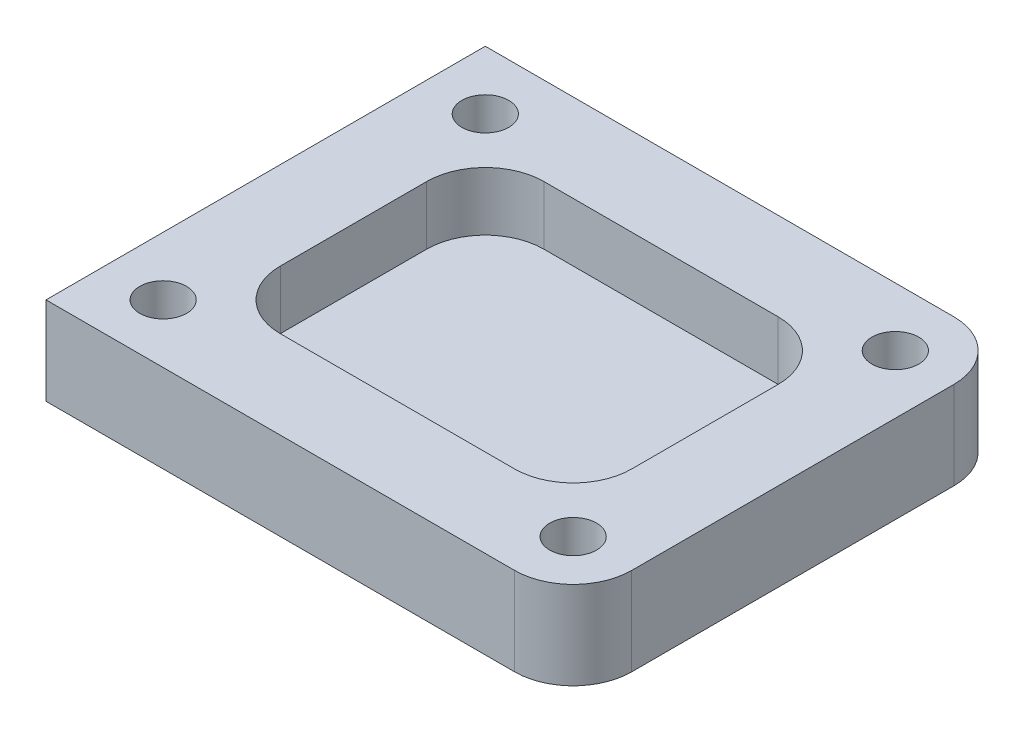
ISO-10303-21;
HEADER;
FILE_DESCRIPTION(('STEP AP214'),'2;1');
FILE_NAME('part.step','',(''),(''),'','','');
FILE_SCHEMA(('AUTOMOTIVE_DESIGN { 1 0 10303 214 1 1 1 1 }'));
ENDSEC;
DATA;
#1=APPLICATION_CONTEXT('core data for automotive mechanical design processes');
#2=APPLICATION_PROTOCOL_DEFINITION('international standard','automotive_design',2000,#1);
#3=PRODUCT_CONTEXT('',#1,'mechanical');
#4=PRODUCT('Part','Part','',(#3));
#5=PRODUCT_RELATED_PRODUCT_CATEGORY('part','',(#4));
#6=PRODUCT_DEFINITION_FORMATION('','',#4);
#7=PRODUCT_DEFINITION_CONTEXT('part definition',#1,'design');
#8=PRODUCT_DEFINITION('design','',#6,#7);
#9=PRODUCT_DEFINITION_SHAPE('','',#8);
#10=(LENGTH_UNIT() NAMED_UNIT(*) SI_UNIT(.MILLI.,.METRE.));
#11=(NAMED_UNIT(*) PLANE_ANGLE_UNIT() SI_UNIT($,.RADIAN.));
#12=(NAMED_UNIT(*) SI_UNIT($,.STERADIAN.) SOLID_ANGLE_UNIT());
#13=UNCERTAINTY_MEASURE_WITH_UNIT(LENGTH_MEASURE(1.E-05),#10,'distance_accuracy_value','');
#14=(GEOMETRIC_REPRESENTATION_CONTEXT(3) GLOBAL_UNCERTAINTY_ASSIGNED_CONTEXT((#13)) GLOBAL_UNIT_ASSIGNED_CONTEXT((#10,
#11,#12)) REPRESENTATION_CONTEXT('',''));
#15=CARTESIAN_POINT('',(0.,0.,0.));
#16=DIRECTION('',(0.,0.,1.));
#17=DIRECTION('',(1.,0.,0.));
#18=AXIS2_PLACEMENT_3D('',#15,#16,#17);
#19=CARTESIAN_POINT('',(90.,30.,75.));
#20=DIRECTION('',(-1.,0.,0.));
#21=DIRECTION('',(0.,0.,1.));
#22=AXIS2_PLACEMENT_3D('',#19,#20,#21);
#23=PLANE('',#22);
#24=DIRECTION('',(0.,0.,-1.));
#25=VECTOR('',#24,1.);
#26=CARTESIAN_POINT('',(90.,30.,75.));
#27=LINE('',#26,#25);
#28=CARTESIAN_POINT('',(90.,30.,55.));
#29=VERTEX_POINT('',#28);
#30=CARTESIAN_POINT('',(90.,30.,-55.));
#31=VERTEX_POINT('',#30);
#32=EDGE_CURVE('E194',#29,#31,#27,.T.);
#33=ORIENTED_EDGE('',*,*,#32,.F.);
#34=DIRECTION('',(0.,-1.,0.));
#35=VECTOR('',#34,1.);
#36=CARTESIAN_POINT('',(90.,30.,55.));
#37=LINE('',#36,#35);
#38=CARTESIAN_POINT('',(90.,0.,55.));
#39=VERTEX_POINT('',#38);
#40=EDGE_CURVE('E262',#29,#39,#37,.T.);
#41=ORIENTED_EDGE('',*,*,#40,.T.);
#42=DIRECTION('',(0.,0.,-1.));
#43=VECTOR('',#42,1.);
#44=CARTESIAN_POINT('',(90.,0.,75.));
#45=LINE('',#44,#43);
#46=CARTESIAN_POINT('',(90.,0.,-55.));
#47=VERTEX_POINT('',#46);
#48=EDGE_CURVE('E193',#39,#47,#45,.T.);
#49=ORIENTED_EDGE('',*,*,#48,.T.);
#50=DIRECTION('',(0.,-1.,0.));
#51=VECTOR('',#50,1.);
#52=CARTESIAN_POINT('',(90.,30.,-55.));
#53=LINE('',#52,#51);
#54=EDGE_CURVE('E260',#47,#31,#53,.F.);
#55=ORIENTED_EDGE('',*,*,#54,.T.);
#56=EDGE_LOOP('',(#33,#41,#49,#55));
#57=FACE_BOUND('',#56,.T.);
#58=ADVANCED_FACE('F40',(#57),#23,.F.);
#59=CARTESIAN_POINT('',(-90.,30.,-75.));
#60=DIRECTION('',(0.,0.,1.));
#61=DIRECTION('',(1.,0.,0.));
#62=AXIS2_PLACEMENT_3D('',#59,#60,#61);
#63=PLANE('',#62);
#64=DIRECTION('',(-1.,0.,0.));
#65=VECTOR('',#64,1.);
#66=CARTESIAN_POINT('',(-90.,30.,-75.));
#67=LINE('',#66,#65);
#68=CARTESIAN_POINT('',(70.,30.,-75.));
#69=VERTEX_POINT('',#68);
#70=CARTESIAN_POINT('',(-90.,30.,-75.));
#71=VERTEX_POINT('',#70);
#72=EDGE_CURVE('E197',#69,#71,#67,.T.);
#73=ORIENTED_EDGE('',*,*,#72,.F.);
#74=DIRECTION('',(0.,-1.,0.));
#75=VECTOR('',#74,1.);
#76=CARTESIAN_POINT('',(70.,30.,-75.));
#77=LINE('',#76,#75);
#78=CARTESIAN_POINT('',(70.,0.,-75.));
#79=VERTEX_POINT('',#78);
#80=EDGE_CURVE('E12',#69,#79,#77,.T.);
#81=ORIENTED_EDGE('',*,*,#80,.T.);
#82=DIRECTION('',(-1.,0.,0.));
#83=VECTOR('',#82,1.);
#84=CARTESIAN_POINT('',(-90.,0.,-75.));
#85=LINE('',#84,#83);
#86=CARTESIAN_POINT('',(-90.,0.,-75.));
#87=VERTEX_POINT('',#86);
#88=EDGE_CURVE('E210',#79,#87,#85,.T.);
#89=ORIENTED_EDGE('',*,*,#88,.T.);
#90=DIRECTION('',(0.,-1.,0.));
#91=VECTOR('',#90,1.);
#92=CARTESIAN_POINT('',(-90.,30.,-75.));
#93=LINE('',#92,#91);
#94=EDGE_CURVE('E217',#71,#87,#93,.T.);
#95=ORIENTED_EDGE('',*,*,#94,.F.);
#96=EDGE_LOOP('',(#73,#81,#89,#95));
#97=FACE_BOUND('',#96,.T.);
#98=ADVANCED_FACE('F294',(#97),#63,.F.);
#99=CARTESIAN_POINT('',(-90.,30.,75.));
#100=DIRECTION('',(1.,0.,0.));
#101=DIRECTION('',(0.,0.,-1.));
#102=AXIS2_PLACEMENT_3D('',#99,#100,#101);
#103=PLANE('',#102);
#104=DIRECTION('',(0.,0.,1.));
#105=VECTOR('',#104,1.);
#106=CARTESIAN_POINT('',(-90.,0.,75.));
#107=LINE('',#106,#105);
#108=CARTESIAN_POINT('',(-90.,0.,75.));
#109=VERTEX_POINT('',#108);
#110=EDGE_CURVE('E212',#87,#109,#107,.T.);
#111=ORIENTED_EDGE('',*,*,#110,.T.);
#112=DIRECTION('',(0.,-1.,0.));
#113=VECTOR('',#112,1.);
#114=CARTESIAN_POINT('',(-90.,30.,75.));
#115=LINE('',#114,#113);
#116=CARTESIAN_POINT('',(-90.,30.,75.));
#117=VERTEX_POINT('',#116);
#118=EDGE_CURVE('E207',#117,#109,#115,.T.);
#119=ORIENTED_EDGE('',*,*,#118,.F.);
#120=DIRECTION('',(0.,0.,1.));
#121=VECTOR('',#120,1.);
#122=CARTESIAN_POINT('',(-90.,30.,75.));
#123=LINE('',#122,#121);
#124=EDGE_CURVE('E201',#71,#117,#123,.T.);
#125=ORIENTED_EDGE('',*,*,#124,.F.);
#126=ORIENTED_EDGE('',*,*,#94,.T.);
#127=EDGE_LOOP('',(#111,#119,#125,#126));
#128=FACE_BOUND('',#127,.T.);
#129=ADVANCED_FACE('F290',(#128),#103,.F.);
#130=CARTESIAN_POINT('',(-90.,30.,75.));
#131=DIRECTION('',(0.,0.,-1.));
#132=DIRECTION('',(-1.,0.,0.));
#133=AXIS2_PLACEMENT_3D('',#130,#131,#132);
#134=PLANE('',#133);
#135=DIRECTION('',(1.,0.,0.));
#136=VECTOR('',#135,1.);
#137=CARTESIAN_POINT('',(-90.,0.,75.));
#138=LINE('',#137,#136);
#139=CARTESIAN_POINT('',(70.,0.,75.));
#140=VERTEX_POINT('',#139);
#141=EDGE_CURVE('E198',#109,#140,#138,.T.);
#142=ORIENTED_EDGE('',*,*,#141,.T.);
#143=DIRECTION('',(0.,-1.,0.));
#144=VECTOR('',#143,1.);
#145=CARTESIAN_POINT('',(70.,30.,75.));
#146=LINE('',#145,#144);
#147=CARTESIAN_POINT('',(70.,30.,75.));
#148=VERTEX_POINT('',#147);
#149=EDGE_CURVE('E63',#140,#148,#146,.F.);
#150=ORIENTED_EDGE('',*,*,#149,.T.);
#151=DIRECTION('',(1.,0.,0.));
#152=VECTOR('',#151,1.);
#153=CARTESIAN_POINT('',(-90.,30.,75.));
#154=LINE('',#153,#152);
#155=EDGE_CURVE('E204',#117,#148,#154,.T.);
#156=ORIENTED_EDGE('',*,*,#155,.F.);
#157=ORIENTED_EDGE('',*,*,#118,.T.);
#158=EDGE_LOOP('',(#142,#150,#156,#157));
#159=FACE_BOUND('',#158,.T.);
#160=ADVANCED_FACE('F286',(#159),#134,.F.);
#161=CARTESIAN_POINT('',(0.,30.,0.));
#162=DIRECTION('',(0.,-1.,0.));
#163=DIRECTION('',(0.,0.,-1.));
#164=AXIS2_PLACEMENT_3D('',#161,#162,#163);
#165=PLANE('',#164);
#166=DIRECTION('',(-1.,0.,0.));
#167=VECTOR('',#166,1.);
#168=CARTESIAN_POINT('',(60.,30.,-45.));
#169=LINE('',#168,#167);
#170=CARTESIAN_POINT('',(40.,30.,-45.));
#171=VERTEX_POINT('',#170);
#172=CARTESIAN_POINT('',(-40.,30.,-45.));
#173=VERTEX_POINT('',#172);
#174=EDGE_CURVE('E360',#171,#173,#169,.T.);
#175=ORIENTED_EDGE('',*,*,#174,.F.);
#176=CARTESIAN_POINT('',(40.,30.,-25.));
#177=DIRECTION('',(0.,-1.,0.));
#178=DIRECTION('',(0.,0.,-1.));
#179=AXIS2_PLACEMENT_3D('',#176,#177,#178);
#180=CIRCLE('',#179,20.);
#181=CARTESIAN_POINT('',(60.,30.,-25.));
#182=VERTEX_POINT('',#181);
#183=EDGE_CURVE('E254',#171,#182,#180,.T.);
#184=ORIENTED_EDGE('',*,*,#183,.T.);
#185=DIRECTION('',(0.,0.,-1.));
#186=VECTOR('',#185,1.);
#187=CARTESIAN_POINT('',(60.,30.,45.));
#188=LINE('',#187,#186);
#189=CARTESIAN_POINT('',(60.,30.,25.));
#190=VERTEX_POINT('',#189);
#191=EDGE_CURVE('E356',#190,#182,#188,.T.);
#192=ORIENTED_EDGE('',*,*,#191,.F.);
#193=CARTESIAN_POINT('',(40.,30.,25.));
#194=DIRECTION('',(0.,-1.,0.));
#195=DIRECTION('',(0.,0.,-1.));
#196=AXIS2_PLACEMENT_3D('',#193,#194,#195);
#197=CIRCLE('',#196,20.);
#198=CARTESIAN_POINT('',(40.,30.,45.));
#199=VERTEX_POINT('',#198);
#200=EDGE_CURVE('E248',#190,#199,#197,.T.);
#201=ORIENTED_EDGE('',*,*,#200,.T.);
#202=DIRECTION('',(1.,0.,0.));
#203=VECTOR('',#202,1.);
#204=CARTESIAN_POINT('',(-60.,30.,45.));
#205=LINE('',#204,#203);
#206=CARTESIAN_POINT('',(-40.,30.,45.));
#207=VERTEX_POINT('',#206);
#208=EDGE_CURVE('E352',#207,#199,#205,.T.);
#209=ORIENTED_EDGE('',*,*,#208,.F.);
#210=CARTESIAN_POINT('',(-40.,30.,25.));
#211=DIRECTION('',(0.,-1.,0.));
#212=DIRECTION('',(0.,0.,-1.));
#213=AXIS2_PLACEMENT_3D('',#210,#211,#212);
#214=CIRCLE('',#213,20.);
#215=CARTESIAN_POINT('',(-60.,30.,25.));
#216=VERTEX_POINT('',#215);
#217=EDGE_CURVE('E251',#207,#216,#214,.T.);
#218=ORIENTED_EDGE('',*,*,#217,.T.);
#219=DIRECTION('',(0.,0.,1.));
#220=VECTOR('',#219,1.);
#221=CARTESIAN_POINT('',(-60.,30.,-45.));
#222=LINE('',#221,#220);
#223=CARTESIAN_POINT('',(-60.,30.,-25.));
#224=VERTEX_POINT('',#223);
#225=EDGE_CURVE('E351',#224,#216,#222,.T.);
#226=ORIENTED_EDGE('',*,*,#225,.F.);
#227=CARTESIAN_POINT('',(-40.,30.,-25.));
#228=DIRECTION('',(0.,-1.,0.));
#229=DIRECTION('',(0.,0.,-1.));
#230=AXIS2_PLACEMENT_3D('',#227,#228,#229);
#231=CIRCLE('',#230,20.);
#232=EDGE_CURVE('E257',#224,#173,#231,.T.);
#233=ORIENTED_EDGE('',*,*,#232,.T.);
#234=EDGE_LOOP('',(#175,#184,#192,#201,#209,#218,#226,#233));
#235=FACE_BOUND('',#234,.T.);
#236=CARTESIAN_POINT('',(-70.,30.,55.));
#237=DIRECTION('',(0.,1.,0.));
#238=DIRECTION('',(0.,0.,1.));
#239=AXIS2_PLACEMENT_3D('',#236,#237,#238);
#240=CIRCLE('',#239,7.99999999999999);
#241=CARTESIAN_POINT('',(-70.,30.,63.));
#242=VERTEX_POINT('',#241);
#243=EDGE_CURVE('E165',#242,#242,#240,.T.);
#244=ORIENTED_EDGE('',*,*,#243,.F.);
#245=EDGE_LOOP('',(#244));
#246=FACE_BOUND('',#245,.T.);
#247=CARTESIAN_POINT('',(-70.,30.,-55.));
#248=DIRECTION('',(0.,1.,0.));
#249=DIRECTION('',(0.,0.,1.));
#250=AXIS2_PLACEMENT_3D('',#247,#248,#249);
#251=CIRCLE('',#250,7.99999999999999);
#252=CARTESIAN_POINT('',(-70.,30.,-47.));
#253=VERTEX_POINT('',#252);
#254=EDGE_CURVE('E164',#253,#253,#251,.T.);
#255=ORIENTED_EDGE('',*,*,#254,.F.);
#256=EDGE_LOOP('',(#255));
#257=FACE_BOUND('',#256,.T.);
#258=CARTESIAN_POINT('',(70.,30.,-55.));
#259=DIRECTION('',(0.,1.,0.));
#260=DIRECTION('',(0.,0.,1.));
#261=AXIS2_PLACEMENT_3D('',#258,#259,#260);
#262=CIRCLE('',#261,7.99999999999999);
#263=CARTESIAN_POINT('',(70.,30.,-47.));
#264=VERTEX_POINT('',#263);
#265=EDGE_CURVE('E179',#264,#264,#262,.T.);
#266=ORIENTED_EDGE('',*,*,#265,.F.);
#267=EDGE_LOOP('',(#266));
#268=FACE_BOUND('',#267,.T.);
#269=CARTESIAN_POINT('',(70.,30.,55.));
#270=DIRECTION('',(0.,1.,0.));
#271=DIRECTION('',(0.,0.,1.));
#272=AXIS2_PLACEMENT_3D('',#269,#270,#271);
#273=CIRCLE('',#272,7.99999999999999);
#274=CARTESIAN_POINT('',(70.,30.,63.));
#275=VERTEX_POINT('',#274);
#276=EDGE_CURVE('E186',#275,#275,#273,.T.);
#277=ORIENTED_EDGE('',*,*,#276,.F.);
#278=EDGE_LOOP('',(#277));
#279=FACE_BOUND('',#278,.T.);
#280=ORIENTED_EDGE('',*,*,#155,.T.);
#281=CARTESIAN_POINT('',(70.,30.,55.));
#282=DIRECTION('',(0.,-1.,0.));
#283=DIRECTION('',(0.,0.,-1.));
#284=AXIS2_PLACEMENT_3D('',#281,#282,#283);
#285=CIRCLE('',#284,20.);
#286=EDGE_CURVE('E48',#148,#29,#285,.F.);
#287=ORIENTED_EDGE('',*,*,#286,.T.);
#288=ORIENTED_EDGE('',*,*,#32,.T.);
#289=CARTESIAN_POINT('',(70.,30.,-55.));
#290=DIRECTION('',(0.,-1.,0.));
#291=DIRECTION('',(0.,0.,-1.));
#292=AXIS2_PLACEMENT_3D('',#289,#290,#291);
#293=CIRCLE('',#292,20.);
#294=EDGE_CURVE('E55',#31,#69,#293,.F.);
#295=ORIENTED_EDGE('',*,*,#294,.T.);
#296=ORIENTED_EDGE('',*,*,#72,.T.);
#297=ORIENTED_EDGE('',*,*,#124,.T.);
#298=EDGE_LOOP('',(#280,#287,#288,#295,#296,#297));
#299=FACE_BOUND('',#298,.T.);
#300=ADVANCED_FACE('F275',(#235,#246,#257,#268,#279,#299),#165,.F.);
#301=CARTESIAN_POINT('',(0.,0.,0.));
#302=DIRECTION('',(0.,-1.,0.));
#303=DIRECTION('',(0.,0.,-1.));
#304=AXIS2_PLACEMENT_3D('',#301,#302,#303);
#305=PLANE('',#304);
#306=ORIENTED_EDGE('',*,*,#48,.F.);
#307=CARTESIAN_POINT('',(70.,0.,55.));
#308=DIRECTION('',(0.,-1.,0.));
#309=DIRECTION('',(0.,0.,-1.));
#310=AXIS2_PLACEMENT_3D('',#307,#308,#309);
#311=CIRCLE('',#310,20.);
#312=EDGE_CURVE('E267',#39,#140,#311,.T.);
#313=ORIENTED_EDGE('',*,*,#312,.T.);
#314=ORIENTED_EDGE('',*,*,#141,.F.);
#315=ORIENTED_EDGE('',*,*,#110,.F.);
#316=ORIENTED_EDGE('',*,*,#88,.F.);
#317=CARTESIAN_POINT('',(70.,0.,-55.));
#318=DIRECTION('',(0.,-1.,0.));
#319=DIRECTION('',(0.,0.,-1.));
#320=AXIS2_PLACEMENT_3D('',#317,#318,#319);
#321=CIRCLE('',#320,20.);
#322=EDGE_CURVE('E265',#79,#47,#321,.T.);
#323=ORIENTED_EDGE('',*,*,#322,.T.);
#324=EDGE_LOOP('',(#306,#313,#314,#315,#316,#323));
#325=FACE_BOUND('',#324,.T.);
#326=ADVANCED_FACE('F284',(#325),#305,.T.);
#327=CARTESIAN_POINT('',(70.,15.,55.));
#328=DIRECTION('',(0.,1.,0.));
#329=DIRECTION('',(0.,0.,1.));
#330=AXIS2_PLACEMENT_3D('',#327,#328,#329);
#331=CONICAL_SURFACE('',#330,7.99999999999999,1.02974425867665);
#332=CARTESIAN_POINT('',(70.,10.1931150477795,55.));
#333=VERTEX_POINT('',#332);
#334=VERTEX_LOOP('',#333);
#335=FACE_BOUND('',#334,.T.);
#336=CARTESIAN_POINT('',(70.,15.,55.));
#337=DIRECTION('',(0.,1.,0.));
#338=DIRECTION('',(0.,0.,1.));
#339=AXIS2_PLACEMENT_3D('',#336,#337,#338);
#340=CIRCLE('',#339,7.99999999999999);
#341=CARTESIAN_POINT('',(70.,15.,63.));
#342=VERTEX_POINT('',#341);
#343=EDGE_CURVE('E190',#342,#342,#340,.T.);
#344=ORIENTED_EDGE('',*,*,#343,.T.);
#345=EDGE_LOOP('',(#344));
#346=FACE_BOUND('',#345,.T.);
#347=ADVANCED_FACE('F398',(#335,#346),#331,.F.);
#348=CARTESIAN_POINT('',(70.,30.,55.));
#349=DIRECTION('',(0.,1.,0.));
#350=DIRECTION('',(0.,0.,1.));
#351=AXIS2_PLACEMENT_3D('',#348,#349,#350);
#352=CYLINDRICAL_SURFACE('',#351,7.99999999999999);
#353=ORIENTED_EDGE('',*,*,#343,.F.);
#354=EDGE_LOOP('',(#353));
#355=FACE_BOUND('',#354,.T.);
#356=ORIENTED_EDGE('',*,*,#276,.T.);
#357=EDGE_LOOP('',(#356));
#358=FACE_BOUND('',#357,.T.);
#359=ADVANCED_FACE('F395',(#355,#358),#352,.F.);
#360=CARTESIAN_POINT('',(70.,15.,-55.));
#361=DIRECTION('',(0.,1.,0.));
#362=DIRECTION('',(0.,0.,1.));
#363=AXIS2_PLACEMENT_3D('',#360,#361,#362);
#364=CONICAL_SURFACE('',#363,7.99999999999999,1.02974425867665);
#365=CARTESIAN_POINT('',(70.,10.1931150477795,-55.));
#366=VERTEX_POINT('',#365);
#367=VERTEX_LOOP('',#366);
#368=FACE_BOUND('',#367,.T.);
#369=CARTESIAN_POINT('',(70.,15.,-55.));
#370=DIRECTION('',(0.,1.,0.));
#371=DIRECTION('',(0.,0.,1.));
#372=AXIS2_PLACEMENT_3D('',#369,#370,#371);
#373=CIRCLE('',#372,7.99999999999999);
#374=CARTESIAN_POINT('',(70.,15.,-47.));
#375=VERTEX_POINT('',#374);
#376=EDGE_CURVE('E183',#375,#375,#373,.T.);
#377=ORIENTED_EDGE('',*,*,#376,.T.);
#378=EDGE_LOOP('',(#377));
#379=FACE_BOUND('',#378,.T.);
#380=ADVANCED_FACE('F397',(#368,#379),#364,.F.);
#381=CARTESIAN_POINT('',(70.,30.,-55.));
#382=DIRECTION('',(0.,1.,0.));
#383=DIRECTION('',(0.,0.,1.));
#384=AXIS2_PLACEMENT_3D('',#381,#382,#383);
#385=CYLINDRICAL_SURFACE('',#384,7.99999999999999);
#386=ORIENTED_EDGE('',*,*,#376,.F.);
#387=EDGE_LOOP('',(#386));
#388=FACE_BOUND('',#387,.T.);
#389=ORIENTED_EDGE('',*,*,#265,.T.);
#390=EDGE_LOOP('',(#389));
#391=FACE_BOUND('',#390,.T.);
#392=ADVANCED_FACE('F405',(#388,#391),#385,.F.);
#393=CARTESIAN_POINT('',(-70.,15.,-55.));
#394=DIRECTION('',(0.,1.,0.));
#395=DIRECTION('',(0.,0.,1.));
#396=AXIS2_PLACEMENT_3D('',#393,#394,#395);
#397=CONICAL_SURFACE('',#396,7.99999999999999,1.02974425867665);
#398=CARTESIAN_POINT('',(-70.,10.1931150477795,-55.));
#399=VERTEX_POINT('',#398);
#400=VERTEX_LOOP('',#399);
#401=FACE_BOUND('',#400,.T.);
#402=CARTESIAN_POINT('',(-70.,15.,-55.));
#403=DIRECTION('',(0.,1.,0.));
#404=DIRECTION('',(0.,0.,1.));
#405=AXIS2_PLACEMENT_3D('',#402,#403,#404);
#406=CIRCLE('',#405,7.99999999999999);
#407=CARTESIAN_POINT('',(-70.,15.,-47.));
#408=VERTEX_POINT('',#407);
#409=EDGE_CURVE('E169',#408,#408,#406,.T.);
#410=ORIENTED_EDGE('',*,*,#409,.T.);
#411=EDGE_LOOP('',(#410));
#412=FACE_BOUND('',#411,.T.);
#413=ADVANCED_FACE('F449',(#401,#412),#397,.F.);
#414=CARTESIAN_POINT('',(-70.,30.,-55.));
#415=DIRECTION('',(0.,1.,0.));
#416=DIRECTION('',(0.,0.,1.));
#417=AXIS2_PLACEMENT_3D('',#414,#415,#416);
#418=CYLINDRICAL_SURFACE('',#417,7.99999999999999);
#419=ORIENTED_EDGE('',*,*,#409,.F.);
#420=EDGE_LOOP('',(#419));
#421=FACE_BOUND('',#420,.T.);
#422=ORIENTED_EDGE('',*,*,#254,.T.);
#423=EDGE_LOOP('',(#422));
#424=FACE_BOUND('',#423,.T.);
#425=ADVANCED_FACE('F158',(#421,#424),#418,.F.);
#426=CARTESIAN_POINT('',(-70.,15.,55.));
#427=DIRECTION('',(0.,1.,0.));
#428=DIRECTION('',(0.,0.,1.));
#429=AXIS2_PLACEMENT_3D('',#426,#427,#428);
#430=CONICAL_SURFACE('',#429,7.99999999999999,1.02974425867665);
#431=CARTESIAN_POINT('',(-70.,10.1931150477795,55.));
#432=VERTEX_POINT('',#431);
#433=VERTEX_LOOP('',#432);
#434=FACE_BOUND('',#433,.T.);
#435=CARTESIAN_POINT('',(-70.,15.,55.));
#436=DIRECTION('',(0.,1.,0.));
#437=DIRECTION('',(0.,0.,1.));
#438=AXIS2_PLACEMENT_3D('',#435,#436,#437);
#439=CIRCLE('',#438,7.99999999999999);
#440=CARTESIAN_POINT('',(-70.,15.,63.));
#441=VERTEX_POINT('',#440);
#442=EDGE_CURVE('E162',#441,#441,#439,.T.);
#443=ORIENTED_EDGE('',*,*,#442,.T.);
#444=EDGE_LOOP('',(#443));
#445=FACE_BOUND('',#444,.T.);
#446=ADVANCED_FACE('F154',(#434,#445),#430,.F.);
#447=CARTESIAN_POINT('',(-70.,30.,55.));
#448=DIRECTION('',(0.,1.,0.));
#449=DIRECTION('',(0.,0.,1.));
#450=AXIS2_PLACEMENT_3D('',#447,#448,#449);
#451=CYLINDRICAL_SURFACE('',#450,7.99999999999999);
#452=ORIENTED_EDGE('',*,*,#442,.F.);
#453=EDGE_LOOP('',(#452));
#454=FACE_BOUND('',#453,.T.);
#455=ORIENTED_EDGE('',*,*,#243,.T.);
#456=EDGE_LOOP('',(#455));
#457=FACE_BOUND('',#456,.T.);
#458=ADVANCED_FACE('F157',(#454,#457),#451,.F.);
#459=CARTESIAN_POINT('',(0.,10.,0.));
#460=DIRECTION('',(0.,-1.,0.));
#461=DIRECTION('',(0.,0.,-1.));
#462=AXIS2_PLACEMENT_3D('',#459,#460,#461);
#463=PLANE('',#462);
#464=DIRECTION('',(1.,0.,0.));
#465=VECTOR('',#464,1.);
#466=CARTESIAN_POINT('',(-60.,10.,45.));
#467=LINE('',#466,#465);
#468=CARTESIAN_POINT('',(-40.,10.,45.));
#469=VERTEX_POINT('',#468);
#470=CARTESIAN_POINT('',(40.,10.,45.));
#471=VERTEX_POINT('',#470);
#472=EDGE_CURVE('E173',#469,#471,#467,.T.);
#473=ORIENTED_EDGE('',*,*,#472,.T.);
#474=CARTESIAN_POINT('',(40.,10.,25.));
#475=DIRECTION('',(0.,-1.,0.));
#476=DIRECTION('',(0.,0.,-1.));
#477=AXIS2_PLACEMENT_3D('',#474,#475,#476);
#478=CIRCLE('',#477,20.);
#479=CARTESIAN_POINT('',(60.,10.,25.));
#480=VERTEX_POINT('',#479);
#481=EDGE_CURVE('E236',#471,#480,#478,.F.);
#482=ORIENTED_EDGE('',*,*,#481,.T.);
#483=DIRECTION('',(0.,0.,-1.));
#484=VECTOR('',#483,1.);
#485=CARTESIAN_POINT('',(60.,10.,45.));
#486=LINE('',#485,#484);
#487=CARTESIAN_POINT('',(60.,10.,-25.));
#488=VERTEX_POINT('',#487);
#489=EDGE_CURVE('E347',#480,#488,#486,.T.);
#490=ORIENTED_EDGE('',*,*,#489,.T.);
#491=CARTESIAN_POINT('',(40.,10.,-25.));
#492=DIRECTION('',(0.,-1.,0.));
#493=DIRECTION('',(0.,0.,-1.));
#494=AXIS2_PLACEMENT_3D('',#491,#492,#493);
#495=CIRCLE('',#494,20.);
#496=CARTESIAN_POINT('',(40.,10.,-45.));
#497=VERTEX_POINT('',#496);
#498=EDGE_CURVE('E232',#488,#497,#495,.F.);
#499=ORIENTED_EDGE('',*,*,#498,.T.);
#500=DIRECTION('',(-1.,0.,0.));
#501=VECTOR('',#500,1.);
#502=CARTESIAN_POINT('',(60.,10.,-45.));
#503=LINE('',#502,#501);
#504=CARTESIAN_POINT('',(-40.,10.,-45.));
#505=VERTEX_POINT('',#504);
#506=EDGE_CURVE('E339',#497,#505,#503,.T.);
#507=ORIENTED_EDGE('',*,*,#506,.T.);
#508=CARTESIAN_POINT('',(-40.,10.,-25.));
#509=DIRECTION('',(0.,-1.,0.));
#510=DIRECTION('',(0.,0.,-1.));
#511=AXIS2_PLACEMENT_3D('',#508,#509,#510);
#512=CIRCLE('',#511,20.);
#513=CARTESIAN_POINT('',(-60.,10.,-25.));
#514=VERTEX_POINT('',#513);
#515=EDGE_CURVE('E230',#505,#514,#512,.F.);
#516=ORIENTED_EDGE('',*,*,#515,.T.);
#517=DIRECTION('',(0.,0.,1.));
#518=VECTOR('',#517,1.);
#519=CARTESIAN_POINT('',(-60.,10.,-45.));
#520=LINE('',#519,#518);
#521=CARTESIAN_POINT('',(-60.,10.,25.));
#522=VERTEX_POINT('',#521);
#523=EDGE_CURVE('E336',#514,#522,#520,.T.);
#524=ORIENTED_EDGE('',*,*,#523,.T.);
#525=CARTESIAN_POINT('',(-40.,10.,25.));
#526=DIRECTION('',(0.,-1.,0.));
#527=DIRECTION('',(0.,0.,-1.));
#528=AXIS2_PLACEMENT_3D('',#525,#526,#527);
#529=CIRCLE('',#528,20.);
#530=EDGE_CURVE('E234',#522,#469,#529,.F.);
#531=ORIENTED_EDGE('',*,*,#530,.T.);
#532=EDGE_LOOP('',(#473,#482,#490,#499,#507,#516,#524,#531));
#533=FACE_BOUND('',#532,.T.);
#534=ADVANCED_FACE('F335',(#533),#463,.F.);
#535=CARTESIAN_POINT('',(60.,-150.,45.));
#536=DIRECTION('',(1.,0.,0.));
#537=DIRECTION('',(0.,0.,-1.));
#538=AXIS2_PLACEMENT_3D('',#535,#536,#537);
#539=PLANE('',#538);
#540=ORIENTED_EDGE('',*,*,#489,.F.);
#541=DIRECTION('',(0.,1.,0.));
#542=VECTOR('',#541,1.);
#543=CARTESIAN_POINT('',(60.,30.,25.));
#544=LINE('',#543,#542);
#545=EDGE_CURVE('E222',#480,#190,#544,.T.);
#546=ORIENTED_EDGE('',*,*,#545,.T.);
#547=ORIENTED_EDGE('',*,*,#191,.T.);
#548=DIRECTION('',(0.,1.,0.));
#549=VECTOR('',#548,1.);
#550=CARTESIAN_POINT('',(60.,9.99999999999995,-25.));
#551=LINE('',#550,#549);
#552=EDGE_CURVE('E220',#182,#488,#551,.F.);
#553=ORIENTED_EDGE('',*,*,#552,.T.);
#554=EDGE_LOOP('',(#540,#546,#547,#553));
#555=FACE_BOUND('',#554,.T.);
#556=ADVANCED_FACE('F377',(#555),#539,.F.);
#557=CARTESIAN_POINT('',(60.,-150.,-45.));
#558=DIRECTION('',(0.,0.,-1.));
#559=DIRECTION('',(-1.,0.,0.));
#560=AXIS2_PLACEMENT_3D('',#557,#558,#559);
#561=PLANE('',#560);
#562=ORIENTED_EDGE('',*,*,#506,.F.);
#563=DIRECTION('',(0.,1.,0.));
#564=VECTOR('',#563,1.);
#565=CARTESIAN_POINT('',(40.,30.,-45.));
#566=LINE('',#565,#564);
#567=EDGE_CURVE('E245',#497,#171,#566,.T.);
#568=ORIENTED_EDGE('',*,*,#567,.T.);
#569=ORIENTED_EDGE('',*,*,#174,.T.);
#570=DIRECTION('',(0.,1.,0.));
#571=VECTOR('',#570,1.);
#572=CARTESIAN_POINT('',(-40.,10.,-45.));
#573=LINE('',#572,#571);
#574=EDGE_CURVE('E243',#173,#505,#573,.F.);
#575=ORIENTED_EDGE('',*,*,#574,.T.);
#576=EDGE_LOOP('',(#562,#568,#569,#575));
#577=FACE_BOUND('',#576,.T.);
#578=ADVANCED_FACE('F382',(#577),#561,.F.);
#579=CARTESIAN_POINT('',(-60.,-150.,-45.));
#580=DIRECTION('',(-1.,0.,0.));
#581=DIRECTION('',(0.,0.,1.));
#582=AXIS2_PLACEMENT_3D('',#579,#580,#581);
#583=PLANE('',#582);
#584=ORIENTED_EDGE('',*,*,#225,.T.);
#585=DIRECTION('',(0.,1.,0.));
#586=VECTOR('',#585,1.);
#587=CARTESIAN_POINT('',(-60.,10.,25.));
#588=LINE('',#587,#586);
#589=EDGE_CURVE('E241',#216,#522,#588,.F.);
#590=ORIENTED_EDGE('',*,*,#589,.T.);
#591=ORIENTED_EDGE('',*,*,#523,.F.);
#592=DIRECTION('',(0.,1.,0.));
#593=VECTOR('',#592,1.);
#594=CARTESIAN_POINT('',(-60.,30.,-25.));
#595=LINE('',#594,#593);
#596=EDGE_CURVE('E238',#514,#224,#595,.T.);
#597=ORIENTED_EDGE('',*,*,#596,.T.);
#598=EDGE_LOOP('',(#584,#590,#591,#597));
#599=FACE_BOUND('',#598,.T.);
#600=ADVANCED_FACE('F342',(#599),#583,.F.);
#601=CARTESIAN_POINT('',(-60.,-150.,45.));
#602=DIRECTION('',(0.,0.,1.));
#603=DIRECTION('',(1.,0.,0.));
#604=AXIS2_PLACEMENT_3D('',#601,#602,#603);
#605=PLANE('',#604);
#606=ORIENTED_EDGE('',*,*,#208,.T.);
#607=DIRECTION('',(0.,1.,0.));
#608=VECTOR('',#607,1.);
#609=CARTESIAN_POINT('',(40.,10.,45.));
#610=LINE('',#609,#608);
#611=EDGE_CURVE('E228',#199,#471,#610,.F.);
#612=ORIENTED_EDGE('',*,*,#611,.T.);
#613=ORIENTED_EDGE('',*,*,#472,.F.);
#614=DIRECTION('',(0.,1.,0.));
#615=VECTOR('',#614,1.);
#616=CARTESIAN_POINT('',(-40.,30.,45.));
#617=LINE('',#616,#615);
#618=EDGE_CURVE('E225',#469,#207,#617,.T.);
#619=ORIENTED_EDGE('',*,*,#618,.T.);
#620=EDGE_LOOP('',(#606,#612,#613,#619));
#621=FACE_BOUND('',#620,.T.);
#622=ADVANCED_FACE('F314',(#621),#605,.F.);
#623=CARTESIAN_POINT('',(40.,-150.,25.));
#624=DIRECTION('',(0.,-1.,0.));
#625=DIRECTION('',(0.,0.,-1.));
#626=AXIS2_PLACEMENT_3D('',#623,#624,#625);
#627=CYLINDRICAL_SURFACE('',#626,20.);
#628=ORIENTED_EDGE('',*,*,#481,.F.);
#629=ORIENTED_EDGE('',*,*,#611,.F.);
#630=ORIENTED_EDGE('',*,*,#200,.F.);
#631=ORIENTED_EDGE('',*,*,#545,.F.);
#632=EDGE_LOOP('',(#628,#629,#630,#631));
#633=FACE_BOUND('',#632,.T.);
#634=ADVANCED_FACE('F310',(#633),#627,.F.);
#635=CARTESIAN_POINT('',(-40.,-150.,25.));
#636=DIRECTION('',(0.,-1.,0.));
#637=DIRECTION('',(0.,0.,-1.));
#638=AXIS2_PLACEMENT_3D('',#635,#636,#637);
#639=CYLINDRICAL_SURFACE('',#638,20.);
#640=ORIENTED_EDGE('',*,*,#530,.F.);
#641=ORIENTED_EDGE('',*,*,#589,.F.);
#642=ORIENTED_EDGE('',*,*,#217,.F.);
#643=ORIENTED_EDGE('',*,*,#618,.F.);
#644=EDGE_LOOP('',(#640,#641,#642,#643));
#645=FACE_BOUND('',#644,.T.);
#646=ADVANCED_FACE('F313',(#645),#639,.F.);
#647=CARTESIAN_POINT('',(40.,-150.,-25.));
#648=DIRECTION('',(0.,-1.,0.));
#649=DIRECTION('',(0.,0.,-1.));
#650=AXIS2_PLACEMENT_3D('',#647,#648,#649);
#651=CYLINDRICAL_SURFACE('',#650,20.);
#652=ORIENTED_EDGE('',*,*,#498,.F.);
#653=ORIENTED_EDGE('',*,*,#552,.F.);
#654=ORIENTED_EDGE('',*,*,#183,.F.);
#655=ORIENTED_EDGE('',*,*,#567,.F.);
#656=EDGE_LOOP('',(#652,#653,#654,#655));
#657=FACE_BOUND('',#656,.T.);
#658=ADVANCED_FACE('F318',(#657),#651,.F.);
#659=CARTESIAN_POINT('',(-40.,-150.,-25.));
#660=DIRECTION('',(0.,-1.,0.));
#661=DIRECTION('',(0.,0.,-1.));
#662=AXIS2_PLACEMENT_3D('',#659,#660,#661);
#663=CYLINDRICAL_SURFACE('',#662,20.);
#664=ORIENTED_EDGE('',*,*,#515,.F.);
#665=ORIENTED_EDGE('',*,*,#574,.F.);
#666=ORIENTED_EDGE('',*,*,#232,.F.);
#667=ORIENTED_EDGE('',*,*,#596,.F.);
#668=EDGE_LOOP('',(#664,#665,#666,#667));
#669=FACE_BOUND('',#668,.T.);
#670=ADVANCED_FACE('F301',(#669),#663,.F.);
#671=CARTESIAN_POINT('',(70.,30.,55.));
#672=DIRECTION('',(0.,-1.,0.));
#673=DIRECTION('',(0.,0.,-1.));
#674=AXIS2_PLACEMENT_3D('',#671,#672,#673);
#675=CYLINDRICAL_SURFACE('',#674,20.);
#676=ORIENTED_EDGE('',*,*,#286,.F.);
#677=ORIENTED_EDGE('',*,*,#149,.F.);
#678=ORIENTED_EDGE('',*,*,#312,.F.);
#679=ORIENTED_EDGE('',*,*,#40,.F.);
#680=EDGE_LOOP('',(#676,#677,#678,#679));
#681=FACE_BOUND('',#680,.T.);
#682=ADVANCED_FACE('F281',(#681),#675,.T.);
#683=CARTESIAN_POINT('',(70.,30.,-55.));
#684=DIRECTION('',(0.,-1.,0.));
#685=DIRECTION('',(0.,0.,-1.));
#686=AXIS2_PLACEMENT_3D('',#683,#684,#685);
#687=CYLINDRICAL_SURFACE('',#686,20.);
#688=ORIENTED_EDGE('',*,*,#294,.F.);
#689=ORIENTED_EDGE('',*,*,#54,.F.);
#690=ORIENTED_EDGE('',*,*,#322,.F.);
#691=ORIENTED_EDGE('',*,*,#80,.F.);
#692=EDGE_LOOP('',(#688,#689,#690,#691));
#693=FACE_BOUND('',#692,.T.);
#694=ADVANCED_FACE('F42',(#693),#687,.T.);
#695=CLOSED_SHELL('',(#58,#98,#129,#160,#300,#326,#347,#359,#380,#392,#413,#425,#446,#458,#534,
#556,#578,#600,#622,#634,#646,#658,#670,#682,#694));
#696=MANIFOLD_SOLID_BREP('B2',#695);
#697=ADVANCED_BREP_SHAPE_REPRESENTATION('',(#18,#696),#14);
#698=SHAPE_DEFINITION_REPRESENTATION(#9,#697);
ENDSEC;
END-ISO-10303-21;
